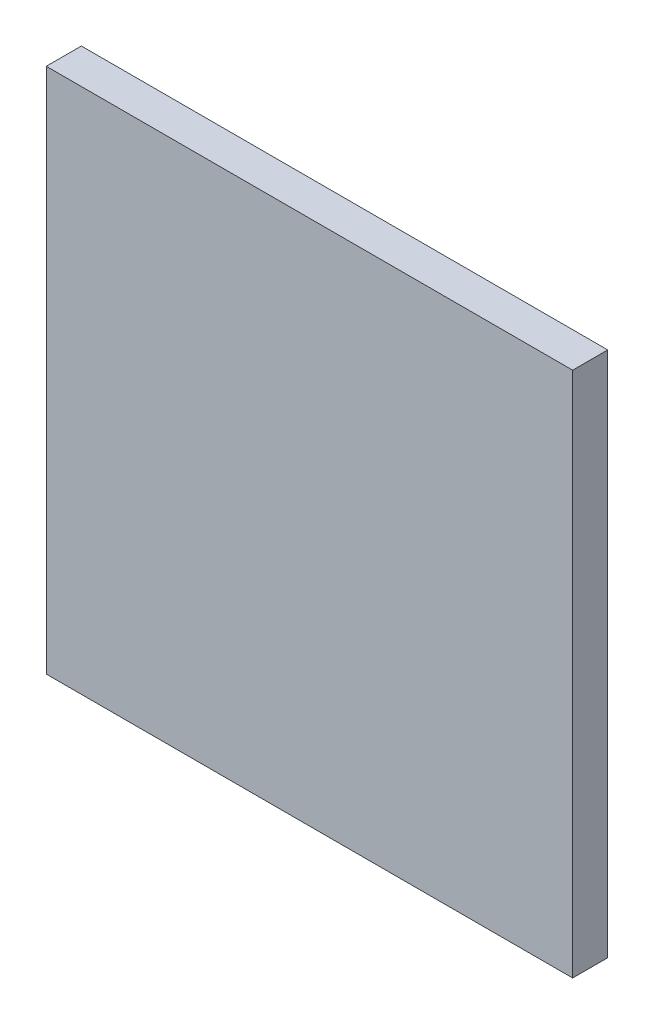
ISO-10303-21;
HEADER;
FILE_DESCRIPTION(('STEP AP214'),'2;1');
FILE_NAME('part.step','',(''),(''),'','','');
FILE_SCHEMA(('AUTOMOTIVE_DESIGN { 1 0 10303 214 1 1 1 1 }'));
ENDSEC;
DATA;
#1=APPLICATION_CONTEXT('core data for automotive mechanical design processes');
#2=APPLICATION_PROTOCOL_DEFINITION('international standard','automotive_design',2000,#1);
#3=PRODUCT_CONTEXT('',#1,'mechanical');
#4=PRODUCT('Part','Part','',(#3));
#5=PRODUCT_RELATED_PRODUCT_CATEGORY('part','',(#4));
#6=PRODUCT_DEFINITION_FORMATION('','',#4);
#7=PRODUCT_DEFINITION_CONTEXT('part definition',#1,'design');
#8=PRODUCT_DEFINITION('design','',#6,#7);
#9=PRODUCT_DEFINITION_SHAPE('','',#8);
#10=(LENGTH_UNIT() NAMED_UNIT(*) SI_UNIT(.MILLI.,.METRE.));
#11=(NAMED_UNIT(*) PLANE_ANGLE_UNIT() SI_UNIT($,.RADIAN.));
#12=(NAMED_UNIT(*) SI_UNIT($,.STERADIAN.) SOLID_ANGLE_UNIT());
#13=UNCERTAINTY_MEASURE_WITH_UNIT(LENGTH_MEASURE(1.E-05),#10,'distance_accuracy_value','');
#14=(GEOMETRIC_REPRESENTATION_CONTEXT(3) GLOBAL_UNCERTAINTY_ASSIGNED_CONTEXT((#13)) GLOBAL_UNIT_ASSIGNED_CONTEXT((#10,
#11,#12)) REPRESENTATION_CONTEXT('',''));
#15=CARTESIAN_POINT('',(0.,0.,0.));
#16=DIRECTION('',(0.,0.,1.));
#17=DIRECTION('',(1.,0.,0.));
#18=AXIS2_PLACEMENT_3D('',#15,#16,#17);
#19=CARTESIAN_POINT('',(-7.5,-7.5,1.));
#20=DIRECTION('',(1.,0.,0.));
#21=DIRECTION('',(0.,0.,-1.));
#22=AXIS2_PLACEMENT_3D('',#19,#20,#21);
#23=PLANE('',#22);
#24=DIRECTION('',(0.,-1.,0.));
#25=VECTOR('',#24,1.);
#26=CARTESIAN_POINT('',(-7.5,-7.5,0.));
#27=LINE('',#26,#25);
#28=CARTESIAN_POINT('',(-7.5,7.5,0.));
#29=VERTEX_POINT('',#28);
#30=CARTESIAN_POINT('',(-7.5,-7.5,0.));
#31=VERTEX_POINT('',#30);
#32=EDGE_CURVE('E95',#29,#31,#27,.T.);
#33=ORIENTED_EDGE('',*,*,#32,.T.);
#34=DIRECTION('',(0.,0.,-1.));
#35=VECTOR('',#34,1.);
#36=CARTESIAN_POINT('',(-7.5,-7.5,1.));
#37=LINE('',#36,#35);
#38=CARTESIAN_POINT('',(-7.5,-7.5,1.));
#39=VERTEX_POINT('',#38);
#40=EDGE_CURVE('E11',#39,#31,#37,.T.);
#41=ORIENTED_EDGE('',*,*,#40,.F.);
#42=DIRECTION('',(0.,-1.,0.));
#43=VECTOR('',#42,1.);
#44=CARTESIAN_POINT('',(-7.5,-7.5,1.));
#45=LINE('',#44,#43);
#46=CARTESIAN_POINT('',(-7.5,7.5,1.));
#47=VERTEX_POINT('',#46);
#48=EDGE_CURVE('E83',#47,#39,#45,.T.);
#49=ORIENTED_EDGE('',*,*,#48,.F.);
#50=DIRECTION('',(0.,0.,-1.));
#51=VECTOR('',#50,1.);
#52=CARTESIAN_POINT('',(-7.5,7.5,1.));
#53=LINE('',#52,#51);
#54=EDGE_CURVE('E91',#47,#29,#53,.T.);
#55=ORIENTED_EDGE('',*,*,#54,.T.);
#56=EDGE_LOOP('',(#33,#41,#49,#55));
#57=FACE_BOUND('',#56,.T.);
#58=ADVANCED_FACE('F32',(#57),#23,.F.);
#59=CARTESIAN_POINT('',(7.5,-7.5,1.));
#60=DIRECTION('',(0.,1.,0.));
#61=DIRECTION('',(0.,0.,1.));
#62=AXIS2_PLACEMENT_3D('',#59,#60,#61);
#63=PLANE('',#62);
#64=DIRECTION('',(1.,0.,0.));
#65=VECTOR('',#64,1.);
#66=CARTESIAN_POINT('',(7.5,-7.5,0.));
#67=LINE('',#66,#65);
#68=CARTESIAN_POINT('',(7.5,-7.5,0.));
#69=VERTEX_POINT('',#68);
#70=EDGE_CURVE('E87',#31,#69,#67,.T.);
#71=ORIENTED_EDGE('',*,*,#70,.T.);
#72=DIRECTION('',(0.,0.,-1.));
#73=VECTOR('',#72,1.);
#74=CARTESIAN_POINT('',(7.5,-7.5,1.));
#75=LINE('',#74,#73);
#76=CARTESIAN_POINT('',(7.5,-7.5,1.));
#77=VERTEX_POINT('',#76);
#78=EDGE_CURVE('E40',#77,#69,#75,.T.);
#79=ORIENTED_EDGE('',*,*,#78,.F.);
#80=DIRECTION('',(1.,0.,0.));
#81=VECTOR('',#80,1.);
#82=CARTESIAN_POINT('',(7.5,-7.5,1.));
#83=LINE('',#82,#81);
#84=EDGE_CURVE('E78',#39,#77,#83,.T.);
#85=ORIENTED_EDGE('',*,*,#84,.F.);
#86=ORIENTED_EDGE('',*,*,#40,.T.);
#87=EDGE_LOOP('',(#71,#79,#85,#86));
#88=FACE_BOUND('',#87,.T.);
#89=ADVANCED_FACE('F86',(#88),#63,.F.);
#90=CARTESIAN_POINT('',(7.5,7.5,1.));
#91=DIRECTION('',(-1.,0.,0.));
#92=DIRECTION('',(0.,0.,1.));
#93=AXIS2_PLACEMENT_3D('',#90,#91,#92);
#94=PLANE('',#93);
#95=DIRECTION('',(0.,1.,0.));
#96=VECTOR('',#95,1.);
#97=CARTESIAN_POINT('',(7.5,7.5,0.));
#98=LINE('',#97,#96);
#99=CARTESIAN_POINT('',(7.5,7.5,0.));
#100=VERTEX_POINT('',#99);
#101=EDGE_CURVE('E65',#69,#100,#98,.T.);
#102=ORIENTED_EDGE('',*,*,#101,.T.);
#103=DIRECTION('',(0.,0.,-1.));
#104=VECTOR('',#103,1.);
#105=CARTESIAN_POINT('',(7.5,7.5,1.));
#106=LINE('',#105,#104);
#107=CARTESIAN_POINT('',(7.5,7.5,1.));
#108=VERTEX_POINT('',#107);
#109=EDGE_CURVE('E88',#108,#100,#106,.T.);
#110=ORIENTED_EDGE('',*,*,#109,.F.);
#111=DIRECTION('',(0.,1.,0.));
#112=VECTOR('',#111,1.);
#113=CARTESIAN_POINT('',(7.5,7.5,1.));
#114=LINE('',#113,#112);
#115=EDGE_CURVE('E81',#77,#108,#114,.T.);
#116=ORIENTED_EDGE('',*,*,#115,.F.);
#117=ORIENTED_EDGE('',*,*,#78,.T.);
#118=EDGE_LOOP('',(#102,#110,#116,#117));
#119=FACE_BOUND('',#118,.T.);
#120=ADVANCED_FACE('F89',(#119),#94,.F.);
#121=CARTESIAN_POINT('',(-7.5,7.5,1.));
#122=DIRECTION('',(0.,-1.,0.));
#123=DIRECTION('',(0.,0.,-1.));
#124=AXIS2_PLACEMENT_3D('',#121,#122,#123);
#125=PLANE('',#124);
#126=DIRECTION('',(-1.,0.,0.));
#127=VECTOR('',#126,1.);
#128=CARTESIAN_POINT('',(-7.5,7.5,0.));
#129=LINE('',#128,#127);
#130=EDGE_CURVE('E71',#100,#29,#129,.T.);
#131=ORIENTED_EDGE('',*,*,#130,.T.);
#132=ORIENTED_EDGE('',*,*,#54,.F.);
#133=DIRECTION('',(-1.,0.,0.));
#134=VECTOR('',#133,1.);
#135=CARTESIAN_POINT('',(-7.5,7.5,1.));
#136=LINE('',#135,#134);
#137=EDGE_CURVE('E48',#108,#47,#136,.T.);
#138=ORIENTED_EDGE('',*,*,#137,.F.);
#139=ORIENTED_EDGE('',*,*,#109,.T.);
#140=EDGE_LOOP('',(#131,#132,#138,#139));
#141=FACE_BOUND('',#140,.T.);
#142=ADVANCED_FACE('F102',(#141),#125,.F.);
#143=CARTESIAN_POINT('',(0.,0.,1.));
#144=DIRECTION('',(0.,0.,-1.));
#145=DIRECTION('',(-1.,0.,0.));
#146=AXIS2_PLACEMENT_3D('',#143,#144,#145);
#147=PLANE('',#146);
#148=ORIENTED_EDGE('',*,*,#48,.T.);
#149=ORIENTED_EDGE('',*,*,#84,.T.);
#150=ORIENTED_EDGE('',*,*,#115,.T.);
#151=ORIENTED_EDGE('',*,*,#137,.T.);
#152=EDGE_LOOP('',(#148,#149,#150,#151));
#153=FACE_BOUND('',#152,.T.);
#154=ADVANCED_FACE('F79',(#153),#147,.F.);
#155=CARTESIAN_POINT('',(0.,0.,0.));
#156=DIRECTION('',(0.,0.,-1.));
#157=DIRECTION('',(-1.,0.,0.));
#158=AXIS2_PLACEMENT_3D('',#155,#156,#157);
#159=PLANE('',#158);
#160=ORIENTED_EDGE('',*,*,#32,.F.);
#161=ORIENTED_EDGE('',*,*,#130,.F.);
#162=ORIENTED_EDGE('',*,*,#101,.F.);
#163=ORIENTED_EDGE('',*,*,#70,.F.);
#164=EDGE_LOOP('',(#160,#161,#162,#163));
#165=FACE_BOUND('',#164,.T.);
#166=ADVANCED_FACE('F105',(#165),#159,.T.);
#167=CLOSED_SHELL('',(#58,#89,#120,#142,#154,#166));
#168=MANIFOLD_SOLID_BREP('B2',#167);
#169=ADVANCED_BREP_SHAPE_REPRESENTATION('',(#18,#168),#14);
#170=SHAPE_DEFINITION_REPRESENTATION(#9,#169);
ENDSEC;
END-ISO-10303-21;
